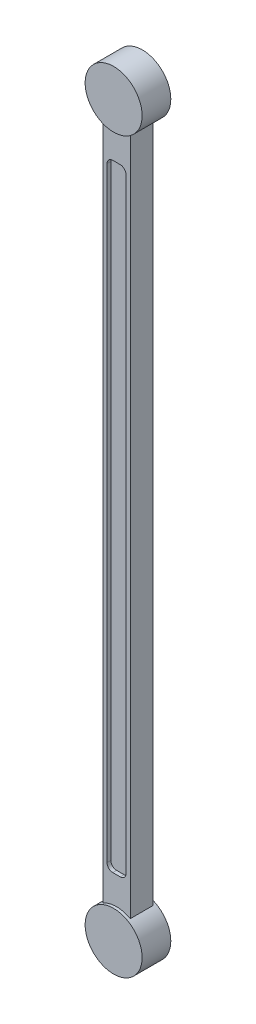
ISO-10303-21;
HEADER;
FILE_DESCRIPTION(('STEP AP214'),'2;1');
FILE_NAME('part.step','',(''),(''),'','','');
FILE_SCHEMA(('AUTOMOTIVE_DESIGN { 1 0 10303 214 1 1 1 1 }'));
ENDSEC;
DATA;
#1=APPLICATION_CONTEXT('core data for automotive mechanical design processes');
#2=APPLICATION_PROTOCOL_DEFINITION('international standard','automotive_design',2000,#1);
#3=PRODUCT_CONTEXT('',#1,'mechanical');
#4=PRODUCT('Part','Part','',(#3));
#5=PRODUCT_RELATED_PRODUCT_CATEGORY('part','',(#4));
#6=PRODUCT_DEFINITION_FORMATION('','',#4);
#7=PRODUCT_DEFINITION_CONTEXT('part definition',#1,'design');
#8=PRODUCT_DEFINITION('design','',#6,#7);
#9=PRODUCT_DEFINITION_SHAPE('','',#8);
#10=(LENGTH_UNIT() NAMED_UNIT(*) SI_UNIT(.MILLI.,.METRE.));
#11=(NAMED_UNIT(*) PLANE_ANGLE_UNIT() SI_UNIT($,.RADIAN.));
#12=(NAMED_UNIT(*) SI_UNIT($,.STERADIAN.) SOLID_ANGLE_UNIT());
#13=UNCERTAINTY_MEASURE_WITH_UNIT(LENGTH_MEASURE(1.E-05),#10,'distance_accuracy_value','');
#14=(GEOMETRIC_REPRESENTATION_CONTEXT(3) GLOBAL_UNCERTAINTY_ASSIGNED_CONTEXT((#13)) GLOBAL_UNIT_ASSIGNED_CONTEXT((#10,
#11,#12)) REPRESENTATION_CONTEXT('',''));
#15=CARTESIAN_POINT('',(0.,0.,0.));
#16=DIRECTION('',(0.,0.,1.));
#17=DIRECTION('',(1.,0.,0.));
#18=AXIS2_PLACEMENT_3D('',#15,#16,#17);
#19=CARTESIAN_POINT('',(0.,1219.99937354261,-19.0000000000001));
#20=DIRECTION('',(0.,0.,1.));
#21=DIRECTION('',(1.,0.,0.));
#22=AXIS2_PLACEMENT_3D('',#19,#20,#21);
#23=PLANE('',#22);
#24=DIRECTION('',(-1.,0.,0.));
#25=VECTOR('',#24,1.);
#26=CARTESIAN_POINT('',(6.23599999997874,93.9993735426106,-19.0000000000001));
#27=LINE('',#26,#25);
#28=CARTESIAN_POINT('',(6.23599999997874,93.9993735426106,-19.0000000000001));
#29=VERTEX_POINT('',#28);
#30=CARTESIAN_POINT('',(-6.23600000002361,93.9993735426106,-19.0000000000001));
#31=VERTEX_POINT('',#30);
#32=EDGE_CURVE('E207',#29,#31,#27,.T.);
#33=ORIENTED_EDGE('',*,*,#32,.F.);
#34=CARTESIAN_POINT('',(6.23599999997874,103.651373542611,-19.0000000000001));
#35=DIRECTION('',(0.,0.,-1.));
#36=DIRECTION('',(-1.,0.,0.));
#37=AXIS2_PLACEMENT_3D('',#34,#35,#36);
#38=CIRCLE('',#37,9.65199999999999);
#39=CARTESIAN_POINT('',(15.8879999999787,103.65137354261,-19.0000000000001));
#40=VERTEX_POINT('',#39);
#41=EDGE_CURVE('E55',#40,#29,#38,.T.);
#42=ORIENTED_EDGE('',*,*,#41,.F.);
#43=DIRECTION('',(0.,-1.,0.));
#44=VECTOR('',#43,1.);
#45=CARTESIAN_POINT('',(15.8879999999995,1116.34737354261,-19.0000000000001));
#46=LINE('',#45,#44);
#47=CARTESIAN_POINT('',(15.8879999999995,1116.34737354261,-19.0000000000001));
#48=VERTEX_POINT('',#47);
#49=EDGE_CURVE('E218',#48,#40,#46,.T.);
#50=ORIENTED_EDGE('',*,*,#49,.F.);
#51=CARTESIAN_POINT('',(6.23599999999932,1116.34737354261,-19.0000000000001));
#52=DIRECTION('',(0.,0.,-1.));
#53=DIRECTION('',(-1.,0.,0.));
#54=AXIS2_PLACEMENT_3D('',#51,#52,#53);
#55=CIRCLE('',#54,9.65200000000019);
#56=CARTESIAN_POINT('',(6.23599999999932,1125.99937354261,-19.0000000000001));
#57=VERTEX_POINT('',#56);
#58=EDGE_CURVE('E254',#57,#48,#55,.T.);
#59=ORIENTED_EDGE('',*,*,#58,.F.);
#60=DIRECTION('',(1.,0.,0.));
#61=VECTOR('',#60,1.);
#62=CARTESIAN_POINT('',(-6.23600000002362,1125.99937354261,-19.0000000000001));
#63=LINE('',#62,#61);
#64=CARTESIAN_POINT('',(-6.23600000002362,1125.99937354261,-19.0000000000001));
#65=VERTEX_POINT('',#64);
#66=EDGE_CURVE('E251',#65,#57,#63,.T.);
#67=ORIENTED_EDGE('',*,*,#66,.F.);
#68=CARTESIAN_POINT('',(-6.23600000002361,1116.34737354261,-19.0000000000001));
#69=DIRECTION('',(0.,0.,-1.));
#70=DIRECTION('',(-1.,0.,0.));
#71=AXIS2_PLACEMENT_3D('',#68,#69,#70);
#72=CIRCLE('',#71,9.652);
#73=CARTESIAN_POINT('',(-15.8880000000236,1116.34737354261,-19.0000000000001));
#74=VERTEX_POINT('',#73);
#75=EDGE_CURVE('E248',#74,#65,#72,.T.);
#76=ORIENTED_EDGE('',*,*,#75,.F.);
#77=DIRECTION('',(0.,1.,0.));
#78=VECTOR('',#77,1.);
#79=CARTESIAN_POINT('',(-15.8880000000236,103.651373542611,-19.0000000000001));
#80=LINE('',#79,#78);
#81=CARTESIAN_POINT('',(-15.8880000000236,103.651373542611,-19.0000000000001));
#82=VERTEX_POINT('',#81);
#83=EDGE_CURVE('E245',#82,#74,#80,.T.);
#84=ORIENTED_EDGE('',*,*,#83,.F.);
#85=CARTESIAN_POINT('',(-6.23600000002361,103.651373542611,-19.0000000000001));
#86=DIRECTION('',(0.,0.,-1.));
#87=DIRECTION('',(-1.,0.,0.));
#88=AXIS2_PLACEMENT_3D('',#85,#86,#87);
#89=CIRCLE('',#88,9.65199999999998);
#90=EDGE_CURVE('E242',#31,#82,#89,.T.);
#91=ORIENTED_EDGE('',*,*,#90,.F.);
#92=EDGE_LOOP('',(#33,#42,#50,#59,#67,#76,#84,#91));
#93=FACE_BOUND('',#92,.T.);
#94=CARTESIAN_POINT('',(0.,0.,-19.0000000000001));
#95=DIRECTION('',(0.,0.,1.));
#96=DIRECTION('',(1.,0.,0.));
#97=AXIS2_PLACEMENT_3D('',#94,#95,#96);
#98=CIRCLE('',#97,47.6571663267766);
#99=CARTESIAN_POINT('',(-23.0000000000236,41.7397352926078,-19.0000000000001));
#100=VERTEX_POINT('',#99);
#101=CARTESIAN_POINT('',(23.0000000000006,41.7397352926205,-19.0000000000001));
#102=VERTEX_POINT('',#101);
#103=EDGE_CURVE('E169',#100,#102,#98,.F.);
#104=ORIENTED_EDGE('',*,*,#103,.F.);
#105=DIRECTION('',(0.,-1.,0.));
#106=VECTOR('',#105,1.);
#107=CARTESIAN_POINT('',(-23.0000000000236,1178.25901179262,-19.0000000000001));
#108=LINE('',#107,#106);
#109=CARTESIAN_POINT('',(-23.0000000000236,1178.25901179262,-19.0000000000001));
#110=VERTEX_POINT('',#109);
#111=EDGE_CURVE('E178',#110,#100,#108,.T.);
#112=ORIENTED_EDGE('',*,*,#111,.F.);
#113=CARTESIAN_POINT('',(0.,1219.99937354261,-19.0000000000001));
#114=DIRECTION('',(0.,0.,1.));
#115=DIRECTION('',(1.,0.,0.));
#116=AXIS2_PLACEMENT_3D('',#113,#114,#115);
#117=CIRCLE('',#116,47.6577149999993);
#118=CARTESIAN_POINT('',(23.0000000000006,1178.25901179261,-19.0000000000001));
#119=VERTEX_POINT('',#118);
#120=EDGE_CURVE('E204',#119,#110,#117,.F.);
#121=ORIENTED_EDGE('',*,*,#120,.F.);
#122=DIRECTION('',(0.,1.,0.));
#123=VECTOR('',#122,1.);
#124=CARTESIAN_POINT('',(23.0000000000006,1178.25901179261,-19.0000000000001));
#125=LINE('',#124,#123);
#126=EDGE_CURVE('E179',#102,#119,#125,.T.);
#127=ORIENTED_EDGE('',*,*,#126,.F.);
#128=EDGE_LOOP('',(#104,#112,#121,#127));
#129=FACE_BOUND('',#128,.T.);
#130=ADVANCED_FACE('F33',(#93,#129),#23,.F.);
#131=CARTESIAN_POINT('',(0.,1219.99937354261,19.05));
#132=DIRECTION('',(0.,0.,1.));
#133=DIRECTION('',(1.,0.,0.));
#134=AXIS2_PLACEMENT_3D('',#131,#132,#133);
#135=PLANE('',#134);
#136=CARTESIAN_POINT('',(6.23599999997874,103.651373542611,19.05));
#137=DIRECTION('',(0.,0.,1.));
#138=DIRECTION('',(1.,0.,0.));
#139=AXIS2_PLACEMENT_3D('',#136,#137,#138);
#140=CIRCLE('',#139,9.65199999999999);
#141=CARTESIAN_POINT('',(6.23599999997874,93.9993735426106,19.05));
#142=VERTEX_POINT('',#141);
#143=CARTESIAN_POINT('',(15.8879999999787,103.65137354261,19.05));
#144=VERTEX_POINT('',#143);
#145=EDGE_CURVE('E261',#142,#144,#140,.T.);
#146=ORIENTED_EDGE('',*,*,#145,.F.);
#147=DIRECTION('',(1.,0.,0.));
#148=VECTOR('',#147,1.);
#149=CARTESIAN_POINT('',(-6.23600000002361,93.9993735426106,19.05));
#150=LINE('',#149,#148);
#151=CARTESIAN_POINT('',(-6.23600000002361,93.9993735426106,19.05));
#152=VERTEX_POINT('',#151);
#153=EDGE_CURVE('E279',#152,#142,#150,.T.);
#154=ORIENTED_EDGE('',*,*,#153,.F.);
#155=CARTESIAN_POINT('',(-6.23600000002361,103.651373542611,19.05));
#156=DIRECTION('',(0.,0.,1.));
#157=DIRECTION('',(-1.,0.,0.));
#158=AXIS2_PLACEMENT_3D('',#155,#156,#157);
#159=CIRCLE('',#158,9.65199999999999);
#160=CARTESIAN_POINT('',(-15.8880000000236,103.651373542611,19.05));
#161=VERTEX_POINT('',#160);
#162=EDGE_CURVE('E317',#161,#152,#159,.T.);
#163=ORIENTED_EDGE('',*,*,#162,.F.);
#164=DIRECTION('',(0.,-1.,0.));
#165=VECTOR('',#164,1.);
#166=CARTESIAN_POINT('',(-15.8880000000236,103.651373542611,19.05));
#167=LINE('',#166,#165);
#168=CARTESIAN_POINT('',(-15.8880000000236,1116.34737354261,19.05));
#169=VERTEX_POINT('',#168);
#170=EDGE_CURVE('E314',#169,#161,#167,.T.);
#171=ORIENTED_EDGE('',*,*,#170,.F.);
#172=CARTESIAN_POINT('',(-6.23600000002361,1116.34737354261,19.05));
#173=DIRECTION('',(0.,0.,1.));
#174=DIRECTION('',(1.,0.,0.));
#175=AXIS2_PLACEMENT_3D('',#172,#173,#174);
#176=CIRCLE('',#175,9.652);
#177=CARTESIAN_POINT('',(-6.23600000002361,1125.99937354261,19.05));
#178=VERTEX_POINT('',#177);
#179=EDGE_CURVE('E311',#178,#169,#176,.T.);
#180=ORIENTED_EDGE('',*,*,#179,.F.);
#181=DIRECTION('',(-1.,0.,0.));
#182=VECTOR('',#181,1.);
#183=CARTESIAN_POINT('',(-6.23600000002361,1125.99937354261,19.05));
#184=LINE('',#183,#182);
#185=CARTESIAN_POINT('',(6.23599999999932,1125.99937354261,19.05));
#186=VERTEX_POINT('',#185);
#187=EDGE_CURVE('E308',#186,#178,#184,.T.);
#188=ORIENTED_EDGE('',*,*,#187,.F.);
#189=CARTESIAN_POINT('',(6.23599999999932,1116.34737354261,19.05));
#190=DIRECTION('',(0.,0.,1.));
#191=DIRECTION('',(-1.,0.,0.));
#192=AXIS2_PLACEMENT_3D('',#189,#190,#191);
#193=CIRCLE('',#192,9.65200000000011);
#194=CARTESIAN_POINT('',(15.8879999999994,1116.34737354261,19.05));
#195=VERTEX_POINT('',#194);
#196=EDGE_CURVE('E305',#195,#186,#193,.T.);
#197=ORIENTED_EDGE('',*,*,#196,.F.);
#198=DIRECTION('',(0.,1.,0.));
#199=VECTOR('',#198,1.);
#200=CARTESIAN_POINT('',(15.8879999999993,1116.34737354261,19.05));
#201=LINE('',#200,#199);
#202=EDGE_CURVE('E302',#144,#195,#201,.T.);
#203=ORIENTED_EDGE('',*,*,#202,.F.);
#204=EDGE_LOOP('',(#146,#154,#163,#171,#180,#188,#197,#203));
#205=FACE_BOUND('',#204,.T.);
#206=DIRECTION('',(0.,-1.,0.));
#207=VECTOR('',#206,1.);
#208=CARTESIAN_POINT('',(-23.0000000000236,1178.25901179262,19.05));
#209=LINE('',#208,#207);
#210=CARTESIAN_POINT('',(-23.0000000000236,1178.25901179262,19.05));
#211=VERTEX_POINT('',#210);
#212=CARTESIAN_POINT('',(-23.0000000000236,41.7397352926079,19.05));
#213=VERTEX_POINT('',#212);
#214=EDGE_CURVE('E189',#211,#213,#209,.T.);
#215=ORIENTED_EDGE('',*,*,#214,.T.);
#216=CARTESIAN_POINT('',(0.,0.,19.05));
#217=DIRECTION('',(0.,0.,1.));
#218=DIRECTION('',(1.,0.,0.));
#219=AXIS2_PLACEMENT_3D('',#216,#217,#218);
#220=CIRCLE('',#219,47.6571663267766);
#221=CARTESIAN_POINT('',(23.0000000000006,41.7397352926205,19.05));
#222=VERTEX_POINT('',#221);
#223=EDGE_CURVE('E48',#213,#222,#220,.F.);
#224=ORIENTED_EDGE('',*,*,#223,.T.);
#225=DIRECTION('',(0.,1.,0.));
#226=VECTOR('',#225,1.);
#227=CARTESIAN_POINT('',(23.0000000000006,1178.25901179261,19.05));
#228=LINE('',#227,#226);
#229=CARTESIAN_POINT('',(23.0000000000006,1178.25901179261,19.05));
#230=VERTEX_POINT('',#229);
#231=EDGE_CURVE('E186',#222,#230,#228,.T.);
#232=ORIENTED_EDGE('',*,*,#231,.T.);
#233=CARTESIAN_POINT('',(0.,1219.99937354261,19.05));
#234=DIRECTION('',(0.,0.,1.));
#235=DIRECTION('',(1.,0.,0.));
#236=AXIS2_PLACEMENT_3D('',#233,#234,#235);
#237=CIRCLE('',#236,47.6577149999993);
#238=EDGE_CURVE('E41',#230,#211,#237,.F.);
#239=ORIENTED_EDGE('',*,*,#238,.T.);
#240=EDGE_LOOP('',(#215,#224,#232,#239));
#241=FACE_BOUND('',#240,.T.);
#242=ADVANCED_FACE('F199',(#205,#241),#135,.T.);
#243=CARTESIAN_POINT('',(23.0000000000006,1178.25901179261,-19.0000000000001));
#244=DIRECTION('',(1.,0.,0.));
#245=DIRECTION('',(0.,0.,-1.));
#246=AXIS2_PLACEMENT_3D('',#243,#244,#245);
#247=PLANE('',#246);
#248=ORIENTED_EDGE('',*,*,#231,.F.);
#249=DIRECTION('',(0.,0.,-1.));
#250=VECTOR('',#249,1.);
#251=CARTESIAN_POINT('',(23.0000000000006,41.7397352926205,23.876));
#252=LINE('',#251,#250);
#253=EDGE_CURVE('E180',#222,#102,#252,.T.);
#254=ORIENTED_EDGE('',*,*,#253,.T.);
#255=ORIENTED_EDGE('',*,*,#126,.T.);
#256=DIRECTION('',(0.,0.,1.));
#257=VECTOR('',#256,1.);
#258=CARTESIAN_POINT('',(23.0000000000006,1178.25901179261,-19.0000000000001));
#259=LINE('',#258,#257);
#260=EDGE_CURVE('E193',#119,#230,#259,.T.);
#261=ORIENTED_EDGE('',*,*,#260,.T.);
#262=EDGE_LOOP('',(#248,#254,#255,#261));
#263=FACE_BOUND('',#262,.T.);
#264=ADVANCED_FACE('F386',(#263),#247,.T.);
#265=CARTESIAN_POINT('',(-23.0000000000236,1178.25901179262,-19.0000000000001));
#266=DIRECTION('',(-1.,0.,0.));
#267=DIRECTION('',(0.,0.,1.));
#268=AXIS2_PLACEMENT_3D('',#265,#266,#267);
#269=PLANE('',#268);
#270=ORIENTED_EDGE('',*,*,#111,.T.);
#271=DIRECTION('',(0.,0.,-1.));
#272=VECTOR('',#271,1.);
#273=CARTESIAN_POINT('',(-23.0000000000236,41.7397352926078,23.876));
#274=LINE('',#273,#272);
#275=EDGE_CURVE('E11',#100,#213,#274,.F.);
#276=ORIENTED_EDGE('',*,*,#275,.T.);
#277=ORIENTED_EDGE('',*,*,#214,.F.);
#278=DIRECTION('',(0.,0.,1.));
#279=VECTOR('',#278,1.);
#280=CARTESIAN_POINT('',(-23.0000000000236,1178.25901179262,-19.0000000000001));
#281=LINE('',#280,#279);
#282=EDGE_CURVE('E185',#110,#211,#281,.T.);
#283=ORIENTED_EDGE('',*,*,#282,.F.);
#284=EDGE_LOOP('',(#270,#276,#277,#283));
#285=FACE_BOUND('',#284,.T.);
#286=ADVANCED_FACE('F183',(#285),#269,.T.);
#287=CARTESIAN_POINT('',(0.,1219.99937354261,-19.0000000000001));
#288=DIRECTION('',(0.,0.,1.));
#289=DIRECTION('',(1.,0.,0.));
#290=AXIS2_PLACEMENT_3D('',#287,#288,#289);
#291=CYLINDRICAL_SURFACE('',#290,47.6577149999993);
#292=ORIENTED_EDGE('',*,*,#282,.T.);
#293=ORIENTED_EDGE('',*,*,#238,.F.);
#294=ORIENTED_EDGE('',*,*,#260,.F.);
#295=ORIENTED_EDGE('',*,*,#120,.T.);
#296=EDGE_LOOP('',(#292,#293,#294,#295));
#297=FACE_BOUND('',#296,.T.);
#298=CARTESIAN_POINT('',(0.,1219.99937354261,23.876));
#299=DIRECTION('',(0.,0.,1.));
#300=DIRECTION('',(1.,0.,0.));
#301=AXIS2_PLACEMENT_3D('',#298,#299,#300);
#302=CIRCLE('',#301,47.6577149999993);
#303=CARTESIAN_POINT('',(47.6577149999993,1219.99937354261,23.876));
#304=VERTEX_POINT('',#303);
#305=EDGE_CURVE('E205',#304,#304,#302,.T.);
#306=ORIENTED_EDGE('',*,*,#305,.F.);
#307=EDGE_LOOP('',(#306));
#308=FACE_BOUND('',#307,.T.);
#309=CARTESIAN_POINT('',(0.,1219.99937354261,-24.13));
#310=DIRECTION('',(0.,0.,1.));
#311=DIRECTION('',(1.,0.,0.));
#312=AXIS2_PLACEMENT_3D('',#309,#310,#311);
#313=CIRCLE('',#312,47.6577149999993);
#314=CARTESIAN_POINT('',(47.6577149999993,1219.99937354261,-24.13));
#315=VERTEX_POINT('',#314);
#316=EDGE_CURVE('E210',#315,#315,#313,.T.);
#317=ORIENTED_EDGE('',*,*,#316,.T.);
#318=EDGE_LOOP('',(#317));
#319=FACE_BOUND('',#318,.T.);
#320=ADVANCED_FACE('F35',(#297,#308,#319),#291,.T.);
#321=CARTESIAN_POINT('',(6.23599999997874,103.651373542611,12.7));
#322=DIRECTION('',(0.,0.,1.));
#323=DIRECTION('',(1.,0.,0.));
#324=AXIS2_PLACEMENT_3D('',#321,#322,#323);
#325=CYLINDRICAL_SURFACE('',#324,9.65199999999999);
#326=ORIENTED_EDGE('',*,*,#145,.T.);
#327=DIRECTION('',(0.,0.,1.));
#328=VECTOR('',#327,1.);
#329=CARTESIAN_POINT('',(15.8879999999787,103.65137354261,12.7));
#330=LINE('',#329,#328);
#331=CARTESIAN_POINT('',(15.8879999999787,103.65137354261,12.7));
#332=VERTEX_POINT('',#331);
#333=EDGE_CURVE('E300',#332,#144,#330,.T.);
#334=ORIENTED_EDGE('',*,*,#333,.F.);
#335=CARTESIAN_POINT('',(6.23599999997874,103.651373542611,12.7));
#336=DIRECTION('',(0.,0.,1.));
#337=DIRECTION('',(1.,0.,0.));
#338=AXIS2_PLACEMENT_3D('',#335,#336,#337);
#339=CIRCLE('',#338,9.65199999999999);
#340=CARTESIAN_POINT('',(6.23599999997874,93.9993735426106,12.7));
#341=VERTEX_POINT('',#340);
#342=EDGE_CURVE('E275',#341,#332,#339,.T.);
#343=ORIENTED_EDGE('',*,*,#342,.F.);
#344=DIRECTION('',(0.,0.,1.));
#345=VECTOR('',#344,1.);
#346=CARTESIAN_POINT('',(6.23599999997874,93.9993735426106,12.7));
#347=LINE('',#346,#345);
#348=EDGE_CURVE('E322',#341,#142,#347,.T.);
#349=ORIENTED_EDGE('',*,*,#348,.T.);
#350=EDGE_LOOP('',(#326,#334,#343,#349));
#351=FACE_BOUND('',#350,.T.);
#352=ADVANCED_FACE('F356',(#351),#325,.F.);
#353=CARTESIAN_POINT('',(-6.23600000002361,93.9993735426106,12.7));
#354=DIRECTION('',(0.,-1.,0.));
#355=DIRECTION('',(1.,0.,0.));
#356=AXIS2_PLACEMENT_3D('',#353,#354,#355);
#357=PLANE('',#356);
#358=ORIENTED_EDGE('',*,*,#153,.T.);
#359=ORIENTED_EDGE('',*,*,#348,.F.);
#360=DIRECTION('',(1.,0.,0.));
#361=VECTOR('',#360,1.);
#362=CARTESIAN_POINT('',(-6.23600000002361,93.9993735426106,12.7));
#363=LINE('',#362,#361);
#364=CARTESIAN_POINT('',(-6.23600000002361,93.9993735426106,12.7));
#365=VERTEX_POINT('',#364);
#366=EDGE_CURVE('E297',#365,#341,#363,.T.);
#367=ORIENTED_EDGE('',*,*,#366,.F.);
#368=DIRECTION('',(0.,0.,1.));
#369=VECTOR('',#368,1.);
#370=CARTESIAN_POINT('',(-6.23600000002361,93.9993735426106,12.7));
#371=LINE('',#370,#369);
#372=EDGE_CURVE('E324',#365,#152,#371,.T.);
#373=ORIENTED_EDGE('',*,*,#372,.T.);
#374=EDGE_LOOP('',(#358,#359,#367,#373));
#375=FACE_BOUND('',#374,.T.);
#376=ADVANCED_FACE('F358',(#375),#357,.F.);
#377=CARTESIAN_POINT('',(-6.23600000002361,103.651373542611,12.7));
#378=DIRECTION('',(0.,0.,1.));
#379=DIRECTION('',(1.,0.,0.));
#380=AXIS2_PLACEMENT_3D('',#377,#378,#379);
#381=CYLINDRICAL_SURFACE('',#380,9.65199999999999);
#382=ORIENTED_EDGE('',*,*,#162,.T.);
#383=ORIENTED_EDGE('',*,*,#372,.F.);
#384=CARTESIAN_POINT('',(-6.23600000002361,103.651373542611,12.7));
#385=DIRECTION('',(0.,0.,1.));
#386=DIRECTION('',(-1.,0.,0.));
#387=AXIS2_PLACEMENT_3D('',#384,#385,#386);
#388=CIRCLE('',#387,9.65199999999999);
#389=CARTESIAN_POINT('',(-15.8880000000236,103.651373542611,12.7));
#390=VERTEX_POINT('',#389);
#391=EDGE_CURVE('E294',#390,#365,#388,.T.);
#392=ORIENTED_EDGE('',*,*,#391,.F.);
#393=DIRECTION('',(0.,0.,1.));
#394=VECTOR('',#393,1.);
#395=CARTESIAN_POINT('',(-15.8880000000236,103.651373542611,12.7));
#396=LINE('',#395,#394);
#397=EDGE_CURVE('E326',#390,#161,#396,.T.);
#398=ORIENTED_EDGE('',*,*,#397,.T.);
#399=EDGE_LOOP('',(#382,#383,#392,#398));
#400=FACE_BOUND('',#399,.T.);
#401=ADVANCED_FACE('F362',(#400),#381,.F.);
#402=CARTESIAN_POINT('',(-15.8880000000236,103.651373542611,12.7));
#403=DIRECTION('',(-1.,0.,0.));
#404=DIRECTION('',(0.,0.,1.));
#405=AXIS2_PLACEMENT_3D('',#402,#403,#404);
#406=PLANE('',#405);
#407=ORIENTED_EDGE('',*,*,#170,.T.);
#408=ORIENTED_EDGE('',*,*,#397,.F.);
#409=DIRECTION('',(0.,-1.,0.));
#410=VECTOR('',#409,1.);
#411=CARTESIAN_POINT('',(-15.8880000000236,103.651373542611,12.7));
#412=LINE('',#411,#410);
#413=CARTESIAN_POINT('',(-15.8880000000236,1116.34737354261,12.7));
#414=VERTEX_POINT('',#413);
#415=EDGE_CURVE('E291',#414,#390,#412,.T.);
#416=ORIENTED_EDGE('',*,*,#415,.F.);
#417=DIRECTION('',(0.,0.,1.));
#418=VECTOR('',#417,1.);
#419=CARTESIAN_POINT('',(-15.8880000000236,1116.34737354261,12.7));
#420=LINE('',#419,#418);
#421=EDGE_CURVE('E328',#414,#169,#420,.T.);
#422=ORIENTED_EDGE('',*,*,#421,.T.);
#423=EDGE_LOOP('',(#407,#408,#416,#422));
#424=FACE_BOUND('',#423,.T.);
#425=ADVANCED_FACE('F366',(#424),#406,.F.);
#426=CARTESIAN_POINT('',(-6.23600000002361,1116.34737354261,12.7));
#427=DIRECTION('',(0.,0.,1.));
#428=DIRECTION('',(1.,0.,0.));
#429=AXIS2_PLACEMENT_3D('',#426,#427,#428);
#430=CYLINDRICAL_SURFACE('',#429,9.652);
#431=ORIENTED_EDGE('',*,*,#179,.T.);
#432=ORIENTED_EDGE('',*,*,#421,.F.);
#433=CARTESIAN_POINT('',(-6.23600000002361,1116.34737354261,12.7));
#434=DIRECTION('',(0.,0.,1.));
#435=DIRECTION('',(1.,0.,0.));
#436=AXIS2_PLACEMENT_3D('',#433,#434,#435);
#437=CIRCLE('',#436,9.652);
#438=CARTESIAN_POINT('',(-6.23600000002361,1125.99937354261,12.7));
#439=VERTEX_POINT('',#438);
#440=EDGE_CURVE('E288',#439,#414,#437,.T.);
#441=ORIENTED_EDGE('',*,*,#440,.F.);
#442=DIRECTION('',(0.,0.,1.));
#443=VECTOR('',#442,1.);
#444=CARTESIAN_POINT('',(-6.23600000002361,1125.99937354261,12.7));
#445=LINE('',#444,#443);
#446=EDGE_CURVE('E330',#439,#178,#445,.T.);
#447=ORIENTED_EDGE('',*,*,#446,.T.);
#448=EDGE_LOOP('',(#431,#432,#441,#447));
#449=FACE_BOUND('',#448,.T.);
#450=ADVANCED_FACE('F369',(#449),#430,.F.);
#451=CARTESIAN_POINT('',(-6.23600000002361,1125.99937354261,12.7));
#452=DIRECTION('',(0.,1.,0.));
#453=DIRECTION('',(-1.,0.,0.));
#454=AXIS2_PLACEMENT_3D('',#451,#452,#453);
#455=PLANE('',#454);
#456=ORIENTED_EDGE('',*,*,#187,.T.);
#457=ORIENTED_EDGE('',*,*,#446,.F.);
#458=DIRECTION('',(-1.,0.,0.));
#459=VECTOR('',#458,1.);
#460=CARTESIAN_POINT('',(-6.23600000002361,1125.99937354261,12.7));
#461=LINE('',#460,#459);
#462=CARTESIAN_POINT('',(6.23599999999932,1125.99937354261,12.7));
#463=VERTEX_POINT('',#462);
#464=EDGE_CURVE('E285',#463,#439,#461,.T.);
#465=ORIENTED_EDGE('',*,*,#464,.F.);
#466=DIRECTION('',(0.,0.,1.));
#467=VECTOR('',#466,1.);
#468=CARTESIAN_POINT('',(6.23599999999932,1125.99937354261,12.7));
#469=LINE('',#468,#467);
#470=EDGE_CURVE('E332',#463,#186,#469,.T.);
#471=ORIENTED_EDGE('',*,*,#470,.T.);
#472=EDGE_LOOP('',(#456,#457,#465,#471));
#473=FACE_BOUND('',#472,.T.);
#474=ADVANCED_FACE('F371',(#473),#455,.F.);
#475=CARTESIAN_POINT('',(6.23599999999932,1116.34737354261,12.7));
#476=DIRECTION('',(0.,0.,1.));
#477=DIRECTION('',(1.,0.,0.));
#478=AXIS2_PLACEMENT_3D('',#475,#476,#477);
#479=CYLINDRICAL_SURFACE('',#478,9.65200000000011);
#480=ORIENTED_EDGE('',*,*,#196,.T.);
#481=ORIENTED_EDGE('',*,*,#470,.F.);
#482=CARTESIAN_POINT('',(6.23599999999932,1116.34737354261,12.7));
#483=DIRECTION('',(0.,0.,1.));
#484=DIRECTION('',(-1.,0.,0.));
#485=AXIS2_PLACEMENT_3D('',#482,#483,#484);
#486=CIRCLE('',#485,9.65200000000011);
#487=CARTESIAN_POINT('',(15.8879999999994,1116.34737354261,12.7));
#488=VERTEX_POINT('',#487);
#489=EDGE_CURVE('E282',#488,#463,#486,.T.);
#490=ORIENTED_EDGE('',*,*,#489,.F.);
#491=DIRECTION('',(0.,0.,1.));
#492=VECTOR('',#491,1.);
#493=CARTESIAN_POINT('',(15.8879999999994,1116.34737354261,12.7));
#494=LINE('',#493,#492);
#495=EDGE_CURVE('E334',#488,#195,#494,.T.);
#496=ORIENTED_EDGE('',*,*,#495,.T.);
#497=EDGE_LOOP('',(#480,#481,#490,#496));
#498=FACE_BOUND('',#497,.T.);
#499=ADVANCED_FACE('F350',(#498),#479,.F.);
#500=CARTESIAN_POINT('',(15.8879999999993,1116.34737354261,12.7));
#501=DIRECTION('',(1.,0.,0.));
#502=DIRECTION('',(0.,1.,0.));
#503=AXIS2_PLACEMENT_3D('',#500,#501,#502);
#504=PLANE('',#503);
#505=ORIENTED_EDGE('',*,*,#202,.T.);
#506=ORIENTED_EDGE('',*,*,#495,.F.);
#507=DIRECTION('',(0.,1.,0.));
#508=VECTOR('',#507,1.);
#509=CARTESIAN_POINT('',(15.8879999999993,1116.34737354261,12.7));
#510=LINE('',#509,#508);
#511=EDGE_CURVE('E278',#332,#488,#510,.T.);
#512=ORIENTED_EDGE('',*,*,#511,.F.);
#513=ORIENTED_EDGE('',*,*,#333,.T.);
#514=EDGE_LOOP('',(#505,#506,#512,#513));
#515=FACE_BOUND('',#514,.T.);
#516=ADVANCED_FACE('F340',(#515),#504,.F.);
#517=CARTESIAN_POINT('',(6.23599999997874,103.651373542611,12.7));
#518=DIRECTION('',(0.,0.,1.));
#519=DIRECTION('',(1.,0.,0.));
#520=AXIS2_PLACEMENT_3D('',#517,#518,#519);
#521=PLANE('',#520);
#522=ORIENTED_EDGE('',*,*,#342,.T.);
#523=ORIENTED_EDGE('',*,*,#511,.T.);
#524=ORIENTED_EDGE('',*,*,#489,.T.);
#525=ORIENTED_EDGE('',*,*,#464,.T.);
#526=ORIENTED_EDGE('',*,*,#440,.T.);
#527=ORIENTED_EDGE('',*,*,#415,.T.);
#528=ORIENTED_EDGE('',*,*,#391,.T.);
#529=ORIENTED_EDGE('',*,*,#366,.T.);
#530=EDGE_LOOP('',(#522,#523,#524,#525,#526,#527,#528,#529));
#531=FACE_BOUND('',#530,.T.);
#532=ADVANCED_FACE('F354',(#531),#521,.T.);
#533=CARTESIAN_POINT('',(6.23599999997874,103.651373542611,-12.6500000000001));
#534=DIRECTION('',(0.,0.,-1.));
#535=DIRECTION('',(-1.,0.,0.));
#536=AXIS2_PLACEMENT_3D('',#533,#534,#535);
#537=CYLINDRICAL_SURFACE('',#536,9.65199999999999);
#538=ORIENTED_EDGE('',*,*,#41,.T.);
#539=DIRECTION('',(0.,0.,-1.));
#540=VECTOR('',#539,1.);
#541=CARTESIAN_POINT('',(6.23599999997874,93.9993735426106,-12.6500000000001));
#542=LINE('',#541,#540);
#543=CARTESIAN_POINT('',(6.23599999997874,93.9993735426106,-12.6500000000001));
#544=VERTEX_POINT('',#543);
#545=EDGE_CURVE('E238',#544,#29,#542,.T.);
#546=ORIENTED_EDGE('',*,*,#545,.F.);
#547=CARTESIAN_POINT('',(6.23599999997874,103.651373542611,-12.6500000000001));
#548=DIRECTION('',(0.,0.,-1.));
#549=DIRECTION('',(-1.,0.,0.));
#550=AXIS2_PLACEMENT_3D('',#547,#548,#549);
#551=CIRCLE('',#550,9.65199999999999);
#552=CARTESIAN_POINT('',(15.8879999999787,103.65137354261,-12.6500000000001));
#553=VERTEX_POINT('',#552);
#554=EDGE_CURVE('E214',#553,#544,#551,.T.);
#555=ORIENTED_EDGE('',*,*,#554,.F.);
#556=DIRECTION('',(0.,0.,-1.));
#557=VECTOR('',#556,1.);
#558=CARTESIAN_POINT('',(15.8879999999787,103.65137354261,-12.6500000000001));
#559=LINE('',#558,#557);
#560=EDGE_CURVE('E259',#553,#40,#559,.T.);
#561=ORIENTED_EDGE('',*,*,#560,.T.);
#562=EDGE_LOOP('',(#538,#546,#555,#561));
#563=FACE_BOUND('',#562,.T.);
#564=ADVANCED_FACE('F409',(#563),#537,.F.);
#565=CARTESIAN_POINT('',(15.8879999999995,1116.34737354261,-12.6500000000001));
#566=DIRECTION('',(1.,0.,0.));
#567=DIRECTION('',(0.,1.,0.));
#568=AXIS2_PLACEMENT_3D('',#565,#566,#567);
#569=PLANE('',#568);
#570=ORIENTED_EDGE('',*,*,#49,.T.);
#571=ORIENTED_EDGE('',*,*,#560,.F.);
#572=DIRECTION('',(0.,-1.,0.));
#573=VECTOR('',#572,1.);
#574=CARTESIAN_POINT('',(15.8879999999995,1116.34737354261,-12.6500000000001));
#575=LINE('',#574,#573);
#576=CARTESIAN_POINT('',(15.8879999999995,1116.34737354261,-12.6500000000001));
#577=VERTEX_POINT('',#576);
#578=EDGE_CURVE('E236',#577,#553,#575,.T.);
#579=ORIENTED_EDGE('',*,*,#578,.F.);
#580=DIRECTION('',(0.,0.,-1.));
#581=VECTOR('',#580,1.);
#582=CARTESIAN_POINT('',(15.8879999999995,1116.34737354261,-12.6500000000001));
#583=LINE('',#582,#581);
#584=EDGE_CURVE('E262',#577,#48,#583,.T.);
#585=ORIENTED_EDGE('',*,*,#584,.T.);
#586=EDGE_LOOP('',(#570,#571,#579,#585));
#587=FACE_BOUND('',#586,.T.);
#588=ADVANCED_FACE('F414',(#587),#569,.F.);
#589=CARTESIAN_POINT('',(6.23599999999932,1116.34737354261,-12.6500000000001));
#590=DIRECTION('',(0.,0.,-1.));
#591=DIRECTION('',(-1.,0.,0.));
#592=AXIS2_PLACEMENT_3D('',#589,#590,#591);
#593=CYLINDRICAL_SURFACE('',#592,9.65200000000019);
#594=ORIENTED_EDGE('',*,*,#58,.T.);
#595=ORIENTED_EDGE('',*,*,#584,.F.);
#596=CARTESIAN_POINT('',(6.23599999999932,1116.34737354261,-12.6500000000001));
#597=DIRECTION('',(0.,0.,-1.));
#598=DIRECTION('',(-1.,0.,0.));
#599=AXIS2_PLACEMENT_3D('',#596,#597,#598);
#600=CIRCLE('',#599,9.65200000000019);
#601=CARTESIAN_POINT('',(6.23599999999932,1125.99937354261,-12.6500000000001));
#602=VERTEX_POINT('',#601);
#603=EDGE_CURVE('E233',#602,#577,#600,.T.);
#604=ORIENTED_EDGE('',*,*,#603,.F.);
#605=DIRECTION('',(0.,0.,-1.));
#606=VECTOR('',#605,1.);
#607=CARTESIAN_POINT('',(6.23599999999932,1125.99937354261,-12.6500000000001));
#608=LINE('',#607,#606);
#609=EDGE_CURVE('E264',#602,#57,#608,.T.);
#610=ORIENTED_EDGE('',*,*,#609,.T.);
#611=EDGE_LOOP('',(#594,#595,#604,#610));
#612=FACE_BOUND('',#611,.T.);
#613=ADVANCED_FACE('F462',(#612),#593,.F.);
#614=CARTESIAN_POINT('',(-6.23600000002362,1125.99937354261,-12.6500000000001));
#615=DIRECTION('',(0.,1.,0.));
#616=DIRECTION('',(-1.,0.,0.));
#617=AXIS2_PLACEMENT_3D('',#614,#615,#616);
#618=PLANE('',#617);
#619=ORIENTED_EDGE('',*,*,#66,.T.);
#620=ORIENTED_EDGE('',*,*,#609,.F.);
#621=DIRECTION('',(1.,0.,0.));
#622=VECTOR('',#621,1.);
#623=CARTESIAN_POINT('',(-6.23600000002362,1125.99937354261,-12.6500000000001));
#624=LINE('',#623,#622);
#625=CARTESIAN_POINT('',(-6.23600000002362,1125.99937354261,-12.6500000000001));
#626=VERTEX_POINT('',#625);
#627=EDGE_CURVE('E230',#626,#602,#624,.T.);
#628=ORIENTED_EDGE('',*,*,#627,.F.);
#629=DIRECTION('',(0.,0.,-1.));
#630=VECTOR('',#629,1.);
#631=CARTESIAN_POINT('',(-6.23600000002362,1125.99937354261,-12.6500000000001));
#632=LINE('',#631,#630);
#633=EDGE_CURVE('E266',#626,#65,#632,.T.);
#634=ORIENTED_EDGE('',*,*,#633,.T.);
#635=EDGE_LOOP('',(#619,#620,#628,#634));
#636=FACE_BOUND('',#635,.T.);
#637=ADVANCED_FACE('F472',(#636),#618,.F.);
#638=CARTESIAN_POINT('',(-6.23600000002361,1116.34737354261,-12.6500000000001));
#639=DIRECTION('',(0.,0.,-1.));
#640=DIRECTION('',(-1.,0.,0.));
#641=AXIS2_PLACEMENT_3D('',#638,#639,#640);
#642=CYLINDRICAL_SURFACE('',#641,9.652);
#643=ORIENTED_EDGE('',*,*,#75,.T.);
#644=ORIENTED_EDGE('',*,*,#633,.F.);
#645=CARTESIAN_POINT('',(-6.23600000002361,1116.34737354261,-12.6500000000001));
#646=DIRECTION('',(0.,0.,-1.));
#647=DIRECTION('',(-1.,0.,0.));
#648=AXIS2_PLACEMENT_3D('',#645,#646,#647);
#649=CIRCLE('',#648,9.652);
#650=CARTESIAN_POINT('',(-15.8880000000236,1116.34737354261,-12.6500000000001));
#651=VERTEX_POINT('',#650);
#652=EDGE_CURVE('E227',#651,#626,#649,.T.);
#653=ORIENTED_EDGE('',*,*,#652,.F.);
#654=DIRECTION('',(0.,0.,-1.));
#655=VECTOR('',#654,1.);
#656=CARTESIAN_POINT('',(-15.8880000000236,1116.34737354261,-12.6500000000001));
#657=LINE('',#656,#655);
#658=EDGE_CURVE('E268',#651,#74,#657,.T.);
#659=ORIENTED_EDGE('',*,*,#658,.T.);
#660=EDGE_LOOP('',(#643,#644,#653,#659));
#661=FACE_BOUND('',#660,.T.);
#662=ADVANCED_FACE('F482',(#661),#642,.F.);
#663=CARTESIAN_POINT('',(-15.8880000000236,103.651373542611,-12.6500000000001));
#664=DIRECTION('',(-1.,0.,0.));
#665=DIRECTION('',(0.,-1.,0.));
#666=AXIS2_PLACEMENT_3D('',#663,#664,#665);
#667=PLANE('',#666);
#668=ORIENTED_EDGE('',*,*,#83,.T.);
#669=ORIENTED_EDGE('',*,*,#658,.F.);
#670=DIRECTION('',(0.,1.,0.));
#671=VECTOR('',#670,1.);
#672=CARTESIAN_POINT('',(-15.8880000000236,103.651373542611,-12.6500000000001));
#673=LINE('',#672,#671);
#674=CARTESIAN_POINT('',(-15.8880000000236,103.651373542611,-12.6500000000001));
#675=VERTEX_POINT('',#674);
#676=EDGE_CURVE('E224',#675,#651,#673,.T.);
#677=ORIENTED_EDGE('',*,*,#676,.F.);
#678=DIRECTION('',(0.,0.,-1.));
#679=VECTOR('',#678,1.);
#680=CARTESIAN_POINT('',(-15.8880000000236,103.651373542611,-12.6500000000001));
#681=LINE('',#680,#679);
#682=EDGE_CURVE('E270',#675,#82,#681,.T.);
#683=ORIENTED_EDGE('',*,*,#682,.T.);
#684=EDGE_LOOP('',(#668,#669,#677,#683));
#685=FACE_BOUND('',#684,.T.);
#686=ADVANCED_FACE('F492',(#685),#667,.F.);
#687=CARTESIAN_POINT('',(-6.23600000002361,103.651373542611,-12.6500000000001));
#688=DIRECTION('',(0.,0.,-1.));
#689=DIRECTION('',(-1.,0.,0.));
#690=AXIS2_PLACEMENT_3D('',#687,#688,#689);
#691=CYLINDRICAL_SURFACE('',#690,9.65199999999998);
#692=ORIENTED_EDGE('',*,*,#90,.T.);
#693=ORIENTED_EDGE('',*,*,#682,.F.);
#694=CARTESIAN_POINT('',(-6.23600000002361,103.651373542611,-12.6500000000001));
#695=DIRECTION('',(0.,0.,-1.));
#696=DIRECTION('',(-1.,0.,0.));
#697=AXIS2_PLACEMENT_3D('',#694,#695,#696);
#698=CIRCLE('',#697,9.65199999999998);
#699=CARTESIAN_POINT('',(-6.23600000002361,93.9993735426106,-12.6500000000001));
#700=VERTEX_POINT('',#699);
#701=EDGE_CURVE('E221',#700,#675,#698,.T.);
#702=ORIENTED_EDGE('',*,*,#701,.F.);
#703=DIRECTION('',(0.,0.,-1.));
#704=VECTOR('',#703,1.);
#705=CARTESIAN_POINT('',(-6.23600000002361,93.9993735426106,-12.6500000000001));
#706=LINE('',#705,#704);
#707=EDGE_CURVE('E272',#700,#31,#706,.T.);
#708=ORIENTED_EDGE('',*,*,#707,.T.);
#709=EDGE_LOOP('',(#692,#693,#702,#708));
#710=FACE_BOUND('',#709,.T.);
#711=ADVANCED_FACE('F502',(#710),#691,.F.);
#712=CARTESIAN_POINT('',(6.23599999997874,93.9993735426106,-12.6500000000001));
#713=DIRECTION('',(0.,-1.,0.));
#714=DIRECTION('',(1.,0.,0.));
#715=AXIS2_PLACEMENT_3D('',#712,#713,#714);
#716=PLANE('',#715);
#717=ORIENTED_EDGE('',*,*,#32,.T.);
#718=ORIENTED_EDGE('',*,*,#707,.F.);
#719=DIRECTION('',(-1.,0.,0.));
#720=VECTOR('',#719,1.);
#721=CARTESIAN_POINT('',(6.23599999997874,93.9993735426106,-12.6500000000001));
#722=LINE('',#721,#720);
#723=EDGE_CURVE('E217',#544,#700,#722,.T.);
#724=ORIENTED_EDGE('',*,*,#723,.F.);
#725=ORIENTED_EDGE('',*,*,#545,.T.);
#726=EDGE_LOOP('',(#717,#718,#724,#725));
#727=FACE_BOUND('',#726,.T.);
#728=ADVANCED_FACE('F512',(#727),#716,.F.);
#729=CARTESIAN_POINT('',(6.23599999997874,103.651373542611,-12.6500000000001));
#730=DIRECTION('',(0.,0.,-1.));
#731=DIRECTION('',(-1.,0.,0.));
#732=AXIS2_PLACEMENT_3D('',#729,#730,#731);
#733=PLANE('',#732);
#734=ORIENTED_EDGE('',*,*,#554,.T.);
#735=ORIENTED_EDGE('',*,*,#723,.T.);
#736=ORIENTED_EDGE('',*,*,#701,.T.);
#737=ORIENTED_EDGE('',*,*,#676,.T.);
#738=ORIENTED_EDGE('',*,*,#652,.T.);
#739=ORIENTED_EDGE('',*,*,#627,.T.);
#740=ORIENTED_EDGE('',*,*,#603,.T.);
#741=ORIENTED_EDGE('',*,*,#578,.T.);
#742=EDGE_LOOP('',(#734,#735,#736,#737,#738,#739,#740,#741));
#743=FACE_BOUND('',#742,.T.);
#744=ADVANCED_FACE('F522',(#743),#733,.T.);
#745=CARTESIAN_POINT('',(0.,1219.99937354261,23.876));
#746=DIRECTION('',(0.,0.,1.));
#747=DIRECTION('',(1.,0.,0.));
#748=AXIS2_PLACEMENT_3D('',#745,#746,#747);
#749=PLANE('',#748);
#750=ORIENTED_EDGE('',*,*,#305,.T.);
#751=EDGE_LOOP('',(#750));
#752=FACE_BOUND('',#751,.T.);
#753=ADVANCED_FACE('F530',(#752),#749,.T.);
#754=CARTESIAN_POINT('',(0.,1219.99937354261,-24.13));
#755=DIRECTION('',(0.,0.,1.));
#756=DIRECTION('',(1.,0.,0.));
#757=AXIS2_PLACEMENT_3D('',#754,#755,#756);
#758=PLANE('',#757);
#759=ORIENTED_EDGE('',*,*,#316,.F.);
#760=EDGE_LOOP('',(#759));
#761=FACE_BOUND('',#760,.T.);
#762=ADVANCED_FACE('F566',(#761),#758,.F.);
#763=CARTESIAN_POINT('',(0.,0.,23.876));
#764=DIRECTION('',(0.,0.,-1.));
#765=DIRECTION('',(-1.,0.,0.));
#766=AXIS2_PLACEMENT_3D('',#763,#764,#765);
#767=CYLINDRICAL_SURFACE('',#766,47.6571663267766);
#768=ORIENTED_EDGE('',*,*,#253,.F.);
#769=ORIENTED_EDGE('',*,*,#223,.F.);
#770=ORIENTED_EDGE('',*,*,#275,.F.);
#771=ORIENTED_EDGE('',*,*,#103,.T.);
#772=EDGE_LOOP('',(#768,#769,#770,#771));
#773=FACE_BOUND('',#772,.T.);
#774=CARTESIAN_POINT('',(0.,0.,23.876));
#775=DIRECTION('',(0.,0.,1.));
#776=DIRECTION('',(1.,0.,0.));
#777=AXIS2_PLACEMENT_3D('',#774,#775,#776);
#778=CIRCLE('',#777,47.6571663267766);
#779=CARTESIAN_POINT('',(47.6571663267766,0.,23.876));
#780=VERTEX_POINT('',#779);
#781=EDGE_CURVE('E612',#780,#780,#778,.T.);
#782=ORIENTED_EDGE('',*,*,#781,.F.);
#783=EDGE_LOOP('',(#782));
#784=FACE_BOUND('',#783,.T.);
#785=CARTESIAN_POINT('',(0.,0.,-24.13));
#786=DIRECTION('',(0.,0.,1.));
#787=DIRECTION('',(1.,0.,0.));
#788=AXIS2_PLACEMENT_3D('',#785,#786,#787);
#789=CIRCLE('',#788,47.6571663267766);
#790=CARTESIAN_POINT('',(47.6571663267766,0.,-24.13));
#791=VERTEX_POINT('',#790);
#792=EDGE_CURVE('E610',#791,#791,#789,.T.);
#793=ORIENTED_EDGE('',*,*,#792,.T.);
#794=EDGE_LOOP('',(#793));
#795=FACE_BOUND('',#794,.T.);
#796=ADVANCED_FACE('F167',(#773,#784,#795),#767,.T.);
#797=CARTESIAN_POINT('',(0.,0.,23.876));
#798=DIRECTION('',(0.,0.,1.));
#799=DIRECTION('',(1.,0.,0.));
#800=AXIS2_PLACEMENT_3D('',#797,#798,#799);
#801=PLANE('',#800);
#802=ORIENTED_EDGE('',*,*,#781,.T.);
#803=EDGE_LOOP('',(#802));
#804=FACE_BOUND('',#803,.T.);
#805=ADVANCED_FACE('F585',(#804),#801,.T.);
#806=CARTESIAN_POINT('',(0.,0.,-24.13));
#807=DIRECTION('',(0.,0.,1.));
#808=DIRECTION('',(1.,0.,0.));
#809=AXIS2_PLACEMENT_3D('',#806,#807,#808);
#810=PLANE('',#809);
#811=ORIENTED_EDGE('',*,*,#792,.F.);
#812=EDGE_LOOP('',(#811));
#813=FACE_BOUND('',#812,.T.);
#814=ADVANCED_FACE('F594',(#813),#810,.F.);
#815=CLOSED_SHELL('',(#130,#242,#264,#286,#320,#352,#376,#401,#425,#450,#474,#499,#516,#532,
#564,#588,#613,#637,#662,#686,#711,#728,#744,#753,#762,#796,#805,#814));
#816=MANIFOLD_SOLID_BREP('B2',#815);
#817=ADVANCED_BREP_SHAPE_REPRESENTATION('',(#18,#816),#14);
#818=SHAPE_DEFINITION_REPRESENTATION(#9,#817);
ENDSEC;
END-ISO-10303-21;
